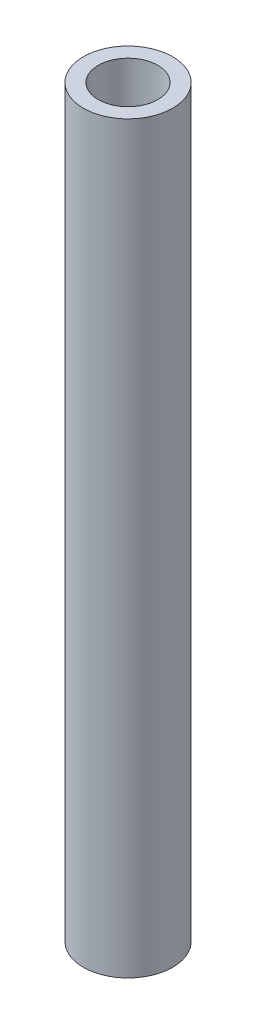
ISO-10303-21;
HEADER;
FILE_DESCRIPTION(('STEP AP214'),'2;1');
FILE_NAME('part.step','',(''),(''),'','','');
FILE_SCHEMA(('AUTOMOTIVE_DESIGN { 1 0 10303 214 1 1 1 1 }'));
ENDSEC;
DATA;
#1=APPLICATION_CONTEXT('core data for automotive mechanical design processes');
#2=APPLICATION_PROTOCOL_DEFINITION('international standard','automotive_design',2000,#1);
#3=PRODUCT_CONTEXT('',#1,'mechanical');
#4=PRODUCT('Part','Part','',(#3));
#5=PRODUCT_RELATED_PRODUCT_CATEGORY('part','',(#4));
#6=PRODUCT_DEFINITION_FORMATION('','',#4);
#7=PRODUCT_DEFINITION_CONTEXT('part definition',#1,'design');
#8=PRODUCT_DEFINITION('design','',#6,#7);
#9=PRODUCT_DEFINITION_SHAPE('','',#8);
#10=(LENGTH_UNIT() NAMED_UNIT(*) SI_UNIT(.MILLI.,.METRE.));
#11=(NAMED_UNIT(*) PLANE_ANGLE_UNIT() SI_UNIT($,.RADIAN.));
#12=(NAMED_UNIT(*) SI_UNIT($,.STERADIAN.) SOLID_ANGLE_UNIT());
#13=UNCERTAINTY_MEASURE_WITH_UNIT(LENGTH_MEASURE(1.E-05),#10,'distance_accuracy_value','');
#14=(GEOMETRIC_REPRESENTATION_CONTEXT(3) GLOBAL_UNCERTAINTY_ASSIGNED_CONTEXT((#13)) GLOBAL_UNIT_ASSIGNED_CONTEXT((#10,
#11,#12)) REPRESENTATION_CONTEXT('',''));
#15=CARTESIAN_POINT('',(0.,0.,0.));
#16=DIRECTION('',(0.,0.,1.));
#17=DIRECTION('',(1.,0.,0.));
#18=AXIS2_PLACEMENT_3D('',#15,#16,#17);
#19=CARTESIAN_POINT('',(0.,-25.,0.));
#20=DIRECTION('',(0.,-1.,0.));
#21=DIRECTION('',(1.,0.,0.));
#22=AXIS2_PLACEMENT_3D('',#19,#20,#21);
#23=PLANE('',#22);
#24=CARTESIAN_POINT('',(0.,-25.,0.));
#25=DIRECTION('',(0.,-1.,0.));
#26=DIRECTION('',(1.,0.,0.));
#27=AXIS2_PLACEMENT_3D('',#24,#25,#26);
#28=CIRCLE('',#27,3.00000000000001);
#29=CARTESIAN_POINT('',(3.00000000000001,-25.,0.));
#30=VERTEX_POINT('',#29);
#31=EDGE_CURVE('E48',#30,#30,#28,.T.);
#32=ORIENTED_EDGE('',*,*,#31,.T.);
#33=EDGE_LOOP('',(#32));
#34=FACE_BOUND('',#33,.T.);
#35=CARTESIAN_POINT('',(0.,-25.,0.));
#36=DIRECTION('',(0.,-1.,0.));
#37=DIRECTION('',(1.,0.,0.));
#38=AXIS2_PLACEMENT_3D('',#35,#36,#37);
#39=CIRCLE('',#38,2.);
#40=CARTESIAN_POINT('',(2.00000000000001,-25.,0.));
#41=VERTEX_POINT('',#40);
#42=EDGE_CURVE('E10',#41,#41,#39,.T.);
#43=ORIENTED_EDGE('',*,*,#42,.F.);
#44=EDGE_LOOP('',(#43));
#45=FACE_BOUND('',#44,.T.);
#46=ADVANCED_FACE('F34',(#34,#45),#23,.T.);
#47=CARTESIAN_POINT('',(0.,-0.72021608418962,0.));
#48=DIRECTION('',(0.,-1.,0.));
#49=DIRECTION('',(1.,0.,0.));
#50=AXIS2_PLACEMENT_3D('',#47,#48,#49);
#51=CYLINDRICAL_SURFACE('',#50,2.);
#52=CARTESIAN_POINT('',(0.,25.,0.));
#53=DIRECTION('',(0.,-1.,0.));
#54=DIRECTION('',(1.,0.,0.));
#55=AXIS2_PLACEMENT_3D('',#52,#53,#54);
#56=CIRCLE('',#55,2.);
#57=CARTESIAN_POINT('',(1.99999999999999,25.,0.));
#58=VERTEX_POINT('',#57);
#59=EDGE_CURVE('E40',#58,#58,#56,.T.);
#60=ORIENTED_EDGE('',*,*,#59,.F.);
#61=EDGE_LOOP('',(#60));
#62=FACE_BOUND('',#61,.T.);
#63=ORIENTED_EDGE('',*,*,#42,.T.);
#64=EDGE_LOOP('',(#63));
#65=FACE_BOUND('',#64,.T.);
#66=ADVANCED_FACE('F64',(#62,#65),#51,.F.);
#67=CARTESIAN_POINT('',(0.,25.,0.));
#68=DIRECTION('',(0.,-1.,0.));
#69=DIRECTION('',(1.,0.,0.));
#70=AXIS2_PLACEMENT_3D('',#67,#68,#69);
#71=PLANE('',#70);
#72=CARTESIAN_POINT('',(0.,25.,0.));
#73=DIRECTION('',(0.,-1.,0.));
#74=DIRECTION('',(1.,0.,0.));
#75=AXIS2_PLACEMENT_3D('',#72,#73,#74);
#76=CIRCLE('',#75,3.);
#77=CARTESIAN_POINT('',(2.99999999999999,25.,0.));
#78=VERTEX_POINT('',#77);
#79=EDGE_CURVE('E44',#78,#78,#76,.T.);
#80=ORIENTED_EDGE('',*,*,#79,.F.);
#81=EDGE_LOOP('',(#80));
#82=FACE_BOUND('',#81,.T.);
#83=ORIENTED_EDGE('',*,*,#59,.T.);
#84=EDGE_LOOP('',(#83));
#85=FACE_BOUND('',#84,.T.);
#86=ADVANCED_FACE('F58',(#82,#85),#71,.F.);
#87=CARTESIAN_POINT('',(0.,-0.72021608418962,0.));
#88=DIRECTION('',(0.,-1.,0.));
#89=DIRECTION('',(1.,0.,0.));
#90=AXIS2_PLACEMENT_3D('',#87,#88,#89);
#91=CYLINDRICAL_SURFACE('',#90,3.);
#92=ORIENTED_EDGE('',*,*,#79,.T.);
#93=EDGE_LOOP('',(#92));
#94=FACE_BOUND('',#93,.T.);
#95=ORIENTED_EDGE('',*,*,#31,.F.);
#96=EDGE_LOOP('',(#95));
#97=FACE_BOUND('',#96,.T.);
#98=ADVANCED_FACE('F56',(#94,#97),#91,.T.);
#99=CLOSED_SHELL('',(#46,#66,#86,#98));
#100=MANIFOLD_SOLID_BREP('B2',#99);
#101=ADVANCED_BREP_SHAPE_REPRESENTATION('',(#18,#100),#14);
#102=SHAPE_DEFINITION_REPRESENTATION(#9,#101);
ENDSEC;
END-ISO-10303-21;
